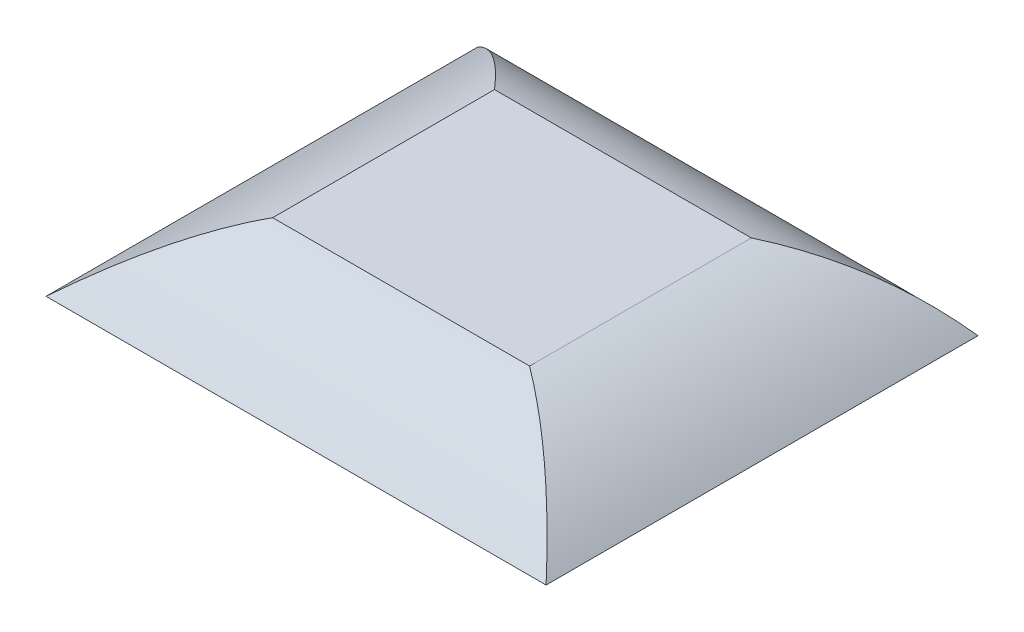
ISO-10303-21;
HEADER;
FILE_DESCRIPTION(('STEP AP214'),'2;1');
FILE_NAME('part.step','',(''),(''),'','','');
FILE_SCHEMA(('AUTOMOTIVE_DESIGN { 1 0 10303 214 1 1 1 1 }'));
ENDSEC;
DATA;
#1=APPLICATION_CONTEXT('core data for automotive mechanical design processes');
#2=APPLICATION_PROTOCOL_DEFINITION('international standard','automotive_design',2000,#1);
#3=PRODUCT_CONTEXT('',#1,'mechanical');
#4=PRODUCT('Part','Part','',(#3));
#5=PRODUCT_RELATED_PRODUCT_CATEGORY('part','',(#4));
#6=PRODUCT_DEFINITION_FORMATION('','',#4);
#7=PRODUCT_DEFINITION_CONTEXT('part definition',#1,'design');
#8=PRODUCT_DEFINITION('design','',#6,#7);
#9=PRODUCT_DEFINITION_SHAPE('','',#8);
#10=(LENGTH_UNIT() NAMED_UNIT(*) SI_UNIT(.MILLI.,.METRE.));
#11=(NAMED_UNIT(*) PLANE_ANGLE_UNIT() SI_UNIT($,.RADIAN.));
#12=(NAMED_UNIT(*) SI_UNIT($,.STERADIAN.) SOLID_ANGLE_UNIT());
#13=UNCERTAINTY_MEASURE_WITH_UNIT(LENGTH_MEASURE(1.E-05),#10,'distance_accuracy_value','');
#14=(GEOMETRIC_REPRESENTATION_CONTEXT(3) GLOBAL_UNCERTAINTY_ASSIGNED_CONTEXT((#13)) GLOBAL_UNIT_ASSIGNED_CONTEXT((#10,
#11,#12)) REPRESENTATION_CONTEXT('',''));
#15=CARTESIAN_POINT('',(0.,0.,0.));
#16=DIRECTION('',(0.,0.,1.));
#17=DIRECTION('',(1.,0.,0.));
#18=AXIS2_PLACEMENT_3D('',#15,#16,#17);
#19=CARTESIAN_POINT('',(0.,1.68019311737324,0.));
#20=DIRECTION('',(0.,1.,0.));
#21=DIRECTION('',(0.,0.,1.));
#22=AXIS2_PLACEMENT_3D('',#19,#20,#21);
#23=PLANE('',#22);
#24=DIRECTION('',(-1.,0.,0.));
#25=VECTOR('',#24,1.);
#26=CARTESIAN_POINT('',(2.82527038966763,1.68019311737324,-2.44000624562205));
#27=LINE('',#26,#25);
#28=CARTESIAN_POINT('',(2.82527038966763,1.68019311737324,-2.44000624562205));
#29=VERTEX_POINT('',#28);
#30=CARTESIAN_POINT('',(-2.82527038966764,1.68019311737324,-2.44000624562205));
#31=VERTEX_POINT('',#30);
#32=EDGE_CURVE('E294',#29,#31,#27,.T.);
#33=ORIENTED_EDGE('',*,*,#32,.T.);
#34=DIRECTION('',(0.,0.,1.));
#35=VECTOR('',#34,1.);
#36=CARTESIAN_POINT('',(-2.82527038966764,1.68019311737324,-2.44000624562205));
#37=LINE('',#36,#35);
#38=CARTESIAN_POINT('',(-2.82527038966764,1.68019311737324,2.44000624562205));
#39=VERTEX_POINT('',#38);
#40=EDGE_CURVE('E168',#31,#39,#37,.T.);
#41=ORIENTED_EDGE('',*,*,#40,.T.);
#42=DIRECTION('',(-1.,0.,0.));
#43=VECTOR('',#42,1.);
#44=CARTESIAN_POINT('',(2.82527038966763,1.68019311737324,2.44000624562205));
#45=LINE('',#44,#43);
#46=CARTESIAN_POINT('',(2.82527038966763,1.68019311737324,2.44000624562205));
#47=VERTEX_POINT('',#46);
#48=EDGE_CURVE('E103',#47,#39,#45,.T.);
#49=ORIENTED_EDGE('',*,*,#48,.F.);
#50=DIRECTION('',(0.,0.,1.));
#51=VECTOR('',#50,1.);
#52=CARTESIAN_POINT('',(2.82527038966763,1.68019311737324,-2.44000624562205));
#53=LINE('',#52,#51);
#54=EDGE_CURVE('E13',#29,#47,#53,.T.);
#55=ORIENTED_EDGE('',*,*,#54,.F.);
#56=EDGE_LOOP('',(#33,#41,#49,#55));
#57=FACE_BOUND('',#56,.T.);
#58=ADVANCED_FACE('F93',(#57),#23,.T.);
#59=CARTESIAN_POINT('',(0.,0.,0.));
#60=DIRECTION('',(0.,-1.,0.));
#61=DIRECTION('',(0.,0.,-1.));
#62=AXIS2_PLACEMENT_3D('',#59,#60,#61);
#63=PLANE('',#62);
#64=DIRECTION('',(0.,0.,-1.));
#65=VECTOR('',#64,1.);
#66=CARTESIAN_POINT('',(5.5,0.,4.75));
#67=LINE('',#66,#65);
#68=CARTESIAN_POINT('',(5.5,0.,4.75));
#69=VERTEX_POINT('',#68);
#70=CARTESIAN_POINT('',(5.5,0.,-4.75));
#71=VERTEX_POINT('',#70);
#72=EDGE_CURVE('E162',#69,#71,#67,.T.);
#73=ORIENTED_EDGE('',*,*,#72,.F.);
#74=DIRECTION('',(1.,0.,0.));
#75=VECTOR('',#74,1.);
#76=CARTESIAN_POINT('',(-5.5,0.,4.75));
#77=LINE('',#76,#75);
#78=CARTESIAN_POINT('',(-5.5,0.,4.75));
#79=VERTEX_POINT('',#78);
#80=EDGE_CURVE('E144',#79,#69,#77,.T.);
#81=ORIENTED_EDGE('',*,*,#80,.F.);
#82=DIRECTION('',(0.,0.,1.));
#83=VECTOR('',#82,1.);
#84=CARTESIAN_POINT('',(-5.5,0.,4.75));
#85=LINE('',#84,#83);
#86=CARTESIAN_POINT('',(-5.5,0.,-4.75));
#87=VERTEX_POINT('',#86);
#88=EDGE_CURVE('E136',#87,#79,#85,.T.);
#89=ORIENTED_EDGE('',*,*,#88,.F.);
#90=DIRECTION('',(-1.,0.,0.));
#91=VECTOR('',#90,1.);
#92=CARTESIAN_POINT('',(-5.5,0.,-4.75));
#93=LINE('',#92,#91);
#94=EDGE_CURVE('E141',#71,#87,#93,.T.);
#95=ORIENTED_EDGE('',*,*,#94,.F.);
#96=EDGE_LOOP('',(#73,#81,#89,#95));
#97=FACE_BOUND('',#96,.T.);
#98=ADVANCED_FACE('F140',(#97),#63,.T.);
#99=CARTESIAN_POINT('',(5.5,0.,4.75));
#100=CARTESIAN_POINT('',(4.7246014378154,0.867223644541501,3.900117669916));
#101=CARTESIAN_POINT('',(3.83302490103795,1.42728801699925,3.13011975179001));
#102=CARTESIAN_POINT('',(2.82527038966763,1.68019311737324,2.44000624562205));
#103=CARTESIAN_POINT('',(5.5,0.,3.95833333333333));
#104=CARTESIAN_POINT('',(4.7246014378154,0.867223644541501,3.23678398960366));
#105=CARTESIAN_POINT('',(3.83302490103795,1.42728801699925,2.59511905783201));
#106=CARTESIAN_POINT('',(2.82527038966763,1.68019311737324,2.03333853801837));
#107=CARTESIAN_POINT('',(5.49999999999999,0.,2.375));
#108=CARTESIAN_POINT('',(4.7246014378154,0.867223644541501,1.91011662897899));
#109=CARTESIAN_POINT('',(3.83302490103795,1.42728801699925,1.525117669916));
#110=CARTESIAN_POINT('',(2.82527038966764,1.68019311737324,1.22000312281102));
#111=CARTESIAN_POINT('',(5.50000000000001,0.,0.));
#112=CARTESIAN_POINT('',(4.72460143781541,0.867223644541501,-0.0798844119580191));
#113=CARTESIAN_POINT('',(3.83302490103795,1.42728801699925,-0.0798844119580181));
#114=CARTESIAN_POINT('',(2.82527038966763,1.68019311737324,0.));
#115=CARTESIAN_POINT('',(5.49999999999999,0.,-2.375));
#116=CARTESIAN_POINT('',(4.7246014378154,0.867223644541501,-2.06988545289503));
#117=CARTESIAN_POINT('',(3.83302490103794,1.42728801699925,-1.68488649383203));
#118=CARTESIAN_POINT('',(2.82527038966763,1.68019311737324,-1.22000312281103));
#119=CARTESIAN_POINT('',(5.5,0.,-3.95833333333333));
#120=CARTESIAN_POINT('',(4.7246014378154,0.867223644541501,-3.3965528135197));
#121=CARTESIAN_POINT('',(3.83302490103795,1.42728801699925,-2.75488788174804));
#122=CARTESIAN_POINT('',(2.82527038966763,1.68019311737324,-2.03333853801837));
#123=CARTESIAN_POINT('',(5.5,0.,-4.75));
#124=CARTESIAN_POINT('',(4.7246014378154,0.867223644541502,-4.05988649383203));
#125=CARTESIAN_POINT('',(3.83302490103795,1.42728801699925,-3.28988857570605));
#126=CARTESIAN_POINT('',(2.82527038966763,1.68019311737324,-2.44000624562205));
#127=B_SPLINE_SURFACE_WITH_KNOTS('',3,3,((#99,#100,#101,#102),(#103,#104,#105,#106),(#107,#108,
#109,#110),(#111,#112,#113,#114),(#115,#116,#117,#118),(#119,#120,#121,#122),(#123,#124,#125,
#126)),.UNSPECIFIED.,.F.,.F.,.F.,(4,1,1,1,4),(4,4),(0.768292682926829,0.826219512195122,
0.884146341463415,0.942073170731707,1.),(0.,1.),.UNSPECIFIED.);
#128=CARTESIAN_POINT('',(5.5,0.,-4.75));
#129=CARTESIAN_POINT('',(4.7246014378154,0.867223644541502,-4.05988649383203));
#130=CARTESIAN_POINT('',(3.83302490103795,1.42728801699925,-3.28988857570605));
#131=CARTESIAN_POINT('',(2.82527038966763,1.68019311737324,-2.44000624562205));
#132=B_SPLINE_CURVE_WITH_KNOTS('',3,(#128,#129,#130,#131),.UNSPECIFIED.,.F.,.F.,(4,4),(0.,1.),.UNSPECIFIED.);
#133=EDGE_CURVE('E161',#71,#29,#132,.T.);
#134=CARTESIAN_POINT('',(5.5,0.,4.75));
#135=CARTESIAN_POINT('',(4.7246014378154,0.867223644541501,3.900117669916));
#136=CARTESIAN_POINT('',(3.83302490103795,1.42728801699925,3.13011975179001));
#137=CARTESIAN_POINT('',(2.82527038966763,1.68019311737324,2.44000624562205));
#138=B_SPLINE_CURVE_WITH_KNOTS('',3,(#134,#135,#136,#137),.UNSPECIFIED.,.F.,.F.,(4,4),(0.,1.),.UNSPECIFIED.);
#139=EDGE_CURVE('E118',#69,#47,#138,.T.);
#140=ORIENTED_EDGE('',*,*,#72,.T.);
#141=ORIENTED_EDGE('',*,*,#133,.T.);
#142=ORIENTED_EDGE('',*,*,#54,.T.);
#143=ORIENTED_EDGE('',*,*,#139,.F.);
#144=EDGE_LOOP('',(#140,#141,#142,#143));
#145=FACE_BOUND('',#144,.T.);
#146=ADVANCED_FACE('F253',(#145),#127,.T.);
#147=CARTESIAN_POINT('',(-5.5,0.,4.75));
#148=CARTESIAN_POINT('',(-4.49224548862969,0.867223644541502,3.900117669916));
#149=CARTESIAN_POINT('',(-3.60066895185223,1.42728801699925,3.13011975179002));
#150=CARTESIAN_POINT('',(-2.82527038966764,1.68019311737324,2.44000624562205));
#151=CARTESIAN_POINT('',(-4.58333333333333,0.,4.75));
#152=CARTESIAN_POINT('',(-3.72417491142593,0.867223644541502,3.900117669916));
#153=CARTESIAN_POINT('',(-2.98119446411138,1.42728801699925,3.13011975179002));
#154=CARTESIAN_POINT('',(-2.3543919913897,1.68019311737324,2.44000624562205));
#155=CARTESIAN_POINT('',(-2.75,0.,4.75));
#156=CARTESIAN_POINT('',(-2.18803375701841,0.867223644541501,3.90011766991599));
#157=CARTESIAN_POINT('',(-1.74224548862969,1.42728801699925,3.13011975179001));
#158=CARTESIAN_POINT('',(-1.41263519483382,1.68019311737324,2.44000624562204));
#159=CARTESIAN_POINT('',(0.,0.,4.75));
#160=CARTESIAN_POINT('',(0.116177974592856,0.867223644541501,3.900117669916));
#161=CARTESIAN_POINT('',(0.116177974592856,1.42728801699925,3.13011975179002));
#162=CARTESIAN_POINT('',(0.,1.68019311737324,2.44000624562205));
#163=CARTESIAN_POINT('',(2.75,0.,4.75));
#164=CARTESIAN_POINT('',(2.42038970620413,0.867223644541501,3.90011766991599));
#165=CARTESIAN_POINT('',(1.9746014378154,1.42728801699925,3.13011975179001));
#166=CARTESIAN_POINT('',(1.41263519483382,1.68019311737324,2.44000624562204));
#167=CARTESIAN_POINT('',(4.58333333333333,0.,4.75));
#168=CARTESIAN_POINT('',(3.95653086061164,0.867223644541501,3.900117669916));
#169=CARTESIAN_POINT('',(3.2135504132971,1.42728801699925,3.13011975179001));
#170=CARTESIAN_POINT('',(2.35439199138969,1.68019311737324,2.44000624562205));
#171=CARTESIAN_POINT('',(5.5,0.,4.75));
#172=CARTESIAN_POINT('',(4.7246014378154,0.867223644541501,3.900117669916));
#173=CARTESIAN_POINT('',(3.83302490103795,1.42728801699925,3.13011975179001));
#174=CARTESIAN_POINT('',(2.82527038966763,1.68019311737324,2.44000624562205));
#175=B_SPLINE_SURFACE_WITH_KNOTS('',3,3,((#147,#148,#149,#150),(#151,#152,#153,#154),(#155,#156,
#157,#158),(#159,#160,#161,#162),(#163,#164,#165,#166),(#167,#168,#169,#170),(#171,#172,#173,
#174)),.UNSPECIFIED.,.F.,.F.,.F.,(4,1,1,1,4),(4,4),(0.5,0.567073170731707,0.634146341463415,
0.701219512195122,0.768292682926829),(0.,1.),.UNSPECIFIED.);
#176=CARTESIAN_POINT('',(-5.5,0.,4.75));
#177=CARTESIAN_POINT('',(-4.49224548862969,0.867223644541502,3.900117669916));
#178=CARTESIAN_POINT('',(-3.60066895185223,1.42728801699925,3.13011975179002));
#179=CARTESIAN_POINT('',(-2.82527038966764,1.68019311737324,2.44000624562205));
#180=B_SPLINE_CURVE_WITH_KNOTS('',3,(#176,#177,#178,#179),.UNSPECIFIED.,.F.,.F.,(4,4),(0.,1.),.UNSPECIFIED.);
#181=EDGE_CURVE('E170',#79,#39,#180,.T.);
#182=ORIENTED_EDGE('',*,*,#80,.T.);
#183=ORIENTED_EDGE('',*,*,#139,.T.);
#184=ORIENTED_EDGE('',*,*,#48,.T.);
#185=ORIENTED_EDGE('',*,*,#181,.F.);
#186=EDGE_LOOP('',(#182,#183,#184,#185));
#187=FACE_BOUND('',#186,.T.);
#188=ADVANCED_FACE('F199',(#187),#175,.T.);
#189=CARTESIAN_POINT('',(-5.5,0.,-4.75));
#190=CARTESIAN_POINT('',(-4.49224548862969,0.8672236445415,-4.05988649383203));
#191=CARTESIAN_POINT('',(-3.60066895185223,1.42728801699925,-3.28988857570605));
#192=CARTESIAN_POINT('',(-2.82527038966764,1.68019311737324,-2.44000624562205));
#193=CARTESIAN_POINT('',(-5.5,0.,-3.95833333333333));
#194=CARTESIAN_POINT('',(-4.49224548862969,0.8672236445415,-3.3965528135197));
#195=CARTESIAN_POINT('',(-3.60066895185223,1.42728801699925,-2.75488788174804));
#196=CARTESIAN_POINT('',(-2.82527038966764,1.68019311737324,-2.03333853801837));
#197=CARTESIAN_POINT('',(-5.5,0.,-2.375));
#198=CARTESIAN_POINT('',(-4.49224548862969,0.867223644541501,-2.06988545289503));
#199=CARTESIAN_POINT('',(-3.60066895185223,1.42728801699925,-1.68488649383203));
#200=CARTESIAN_POINT('',(-2.82527038966764,1.68019311737324,-1.22000312281102));
#201=CARTESIAN_POINT('',(-5.5,0.,0.));
#202=CARTESIAN_POINT('',(-4.49224548862969,0.867223644541501,-0.0798844119580186));
#203=CARTESIAN_POINT('',(-3.60066895185224,1.42728801699925,-0.0798844119580177));
#204=CARTESIAN_POINT('',(-2.82527038966764,1.68019311737324,0.));
#205=CARTESIAN_POINT('',(-5.5,0.,2.375));
#206=CARTESIAN_POINT('',(-4.49224548862969,0.867223644541501,1.91011662897899));
#207=CARTESIAN_POINT('',(-3.60066895185223,1.42728801699925,1.525117669916));
#208=CARTESIAN_POINT('',(-2.82527038966763,1.68019311737324,1.22000312281102));
#209=CARTESIAN_POINT('',(-5.5,0.,3.95833333333333));
#210=CARTESIAN_POINT('',(-4.49224548862969,0.867223644541502,3.23678398960366));
#211=CARTESIAN_POINT('',(-3.60066895185223,1.42728801699925,2.59511905783201));
#212=CARTESIAN_POINT('',(-2.82527038966764,1.68019311737324,2.03333853801837));
#213=CARTESIAN_POINT('',(-5.5,0.,4.75));
#214=CARTESIAN_POINT('',(-4.49224548862969,0.867223644541502,3.900117669916));
#215=CARTESIAN_POINT('',(-3.60066895185223,1.42728801699925,3.13011975179002));
#216=CARTESIAN_POINT('',(-2.82527038966764,1.68019311737324,2.44000624562205));
#217=B_SPLINE_SURFACE_WITH_KNOTS('',3,3,((#189,#190,#191,#192),(#193,#194,#195,#196),(#197,#198,
#199,#200),(#201,#202,#203,#204),(#205,#206,#207,#208),(#209,#210,#211,#212),(#213,#214,#215,
#216)),.UNSPECIFIED.,.F.,.F.,.F.,(4,1,1,1,4),(4,4),(0.268292682926829,0.326219512195122,
0.384146341463415,0.442073170731707,0.5),(0.,1.),.UNSPECIFIED.);
#218=CARTESIAN_POINT('',(-5.5,0.,-4.75));
#219=CARTESIAN_POINT('',(-4.49224548862969,0.8672236445415,-4.05988649383203));
#220=CARTESIAN_POINT('',(-3.60066895185223,1.42728801699925,-3.28988857570605));
#221=CARTESIAN_POINT('',(-2.82527038966764,1.68019311737324,-2.44000624562205));
#222=B_SPLINE_CURVE_WITH_KNOTS('',3,(#218,#219,#220,#221),.UNSPECIFIED.,.F.,.F.,(4,4),(0.,1.),.UNSPECIFIED.);
#223=EDGE_CURVE('E159',#87,#31,#222,.T.);
#224=ORIENTED_EDGE('',*,*,#88,.T.);
#225=ORIENTED_EDGE('',*,*,#181,.T.);
#226=ORIENTED_EDGE('',*,*,#40,.F.);
#227=ORIENTED_EDGE('',*,*,#223,.F.);
#228=EDGE_LOOP('',(#224,#225,#226,#227));
#229=FACE_BOUND('',#228,.T.);
#230=ADVANCED_FACE('F166',(#229),#217,.T.);
#231=CARTESIAN_POINT('',(5.5,0.,-4.75));
#232=CARTESIAN_POINT('',(4.7246014378154,0.867223644541502,-4.05988649383203));
#233=CARTESIAN_POINT('',(3.83302490103795,1.42728801699925,-3.28988857570605));
#234=CARTESIAN_POINT('',(2.82527038966763,1.68019311737324,-2.44000624562205));
#235=CARTESIAN_POINT('',(4.58333333333333,0.,-4.75));
#236=CARTESIAN_POINT('',(3.95653086061165,0.867223644541501,-4.05988649383203));
#237=CARTESIAN_POINT('',(3.2135504132971,1.42728801699925,-3.28988857570605));
#238=CARTESIAN_POINT('',(2.3543919913897,1.68019311737324,-2.44000624562205));
#239=CARTESIAN_POINT('',(2.75,0.,-4.75));
#240=CARTESIAN_POINT('',(2.42038970620413,0.867223644541501,-4.05988649383204));
#241=CARTESIAN_POINT('',(1.9746014378154,1.42728801699925,-3.28988857570605));
#242=CARTESIAN_POINT('',(1.41263519483382,1.68019311737324,-2.44000624562205));
#243=CARTESIAN_POINT('',(0.,0.,-4.74999999999999));
#244=CARTESIAN_POINT('',(0.116177974592857,0.867223644541501,-4.05988649383203));
#245=CARTESIAN_POINT('',(0.116177974592857,1.42728801699925,-3.28988857570605));
#246=CARTESIAN_POINT('',(0.,1.68019311737324,-2.44000624562205));
#247=CARTESIAN_POINT('',(-2.75,0.,-4.75000000000001));
#248=CARTESIAN_POINT('',(-2.18803375701841,0.867223644541501,-4.05988649383204));
#249=CARTESIAN_POINT('',(-1.74224548862969,1.42728801699925,-3.28988857570605));
#250=CARTESIAN_POINT('',(-1.41263519483382,1.68019311737324,-2.44000624562205));
#251=CARTESIAN_POINT('',(-4.58333333333333,0.,-4.75));
#252=CARTESIAN_POINT('',(-3.72417491142593,0.867223644541501,-4.05988649383203));
#253=CARTESIAN_POINT('',(-2.98119446411138,1.42728801699925,-3.28988857570605));
#254=CARTESIAN_POINT('',(-2.3543919913897,1.68019311737324,-2.44000624562205));
#255=CARTESIAN_POINT('',(-5.5,0.,-4.75));
#256=CARTESIAN_POINT('',(-4.49224548862969,0.8672236445415,-4.05988649383203));
#257=CARTESIAN_POINT('',(-3.60066895185223,1.42728801699925,-3.28988857570605));
#258=CARTESIAN_POINT('',(-2.82527038966764,1.68019311737324,-2.44000624562205));
#259=B_SPLINE_SURFACE_WITH_KNOTS('',3,3,((#231,#232,#233,#234),(#235,#236,#237,#238),(#239,#240,
#241,#242),(#243,#244,#245,#246),(#247,#248,#249,#250),(#251,#252,#253,#254),(#255,#256,#257,
#258)),.UNSPECIFIED.,.F.,.F.,.F.,(4,1,1,1,4),(4,4),(0.,0.0670731707317073,0.134146341463415,
0.201219512195122,0.268292682926829),(0.,1.),.UNSPECIFIED.);
#260=ORIENTED_EDGE('',*,*,#94,.T.);
#261=ORIENTED_EDGE('',*,*,#223,.T.);
#262=ORIENTED_EDGE('',*,*,#32,.F.);
#263=ORIENTED_EDGE('',*,*,#133,.F.);
#264=EDGE_LOOP('',(#260,#261,#262,#263));
#265=FACE_BOUND('',#264,.T.);
#266=ADVANCED_FACE('F158',(#265),#259,.T.);
#267=CLOSED_SHELL('',(#58,#98,#146,#188,#230,#266));
#268=MANIFOLD_SOLID_BREP('B2',#267);
#269=ADVANCED_BREP_SHAPE_REPRESENTATION('',(#18,#268),#14);
#270=SHAPE_DEFINITION_REPRESENTATION(#9,#269);
ENDSEC;
END-ISO-10303-21;
